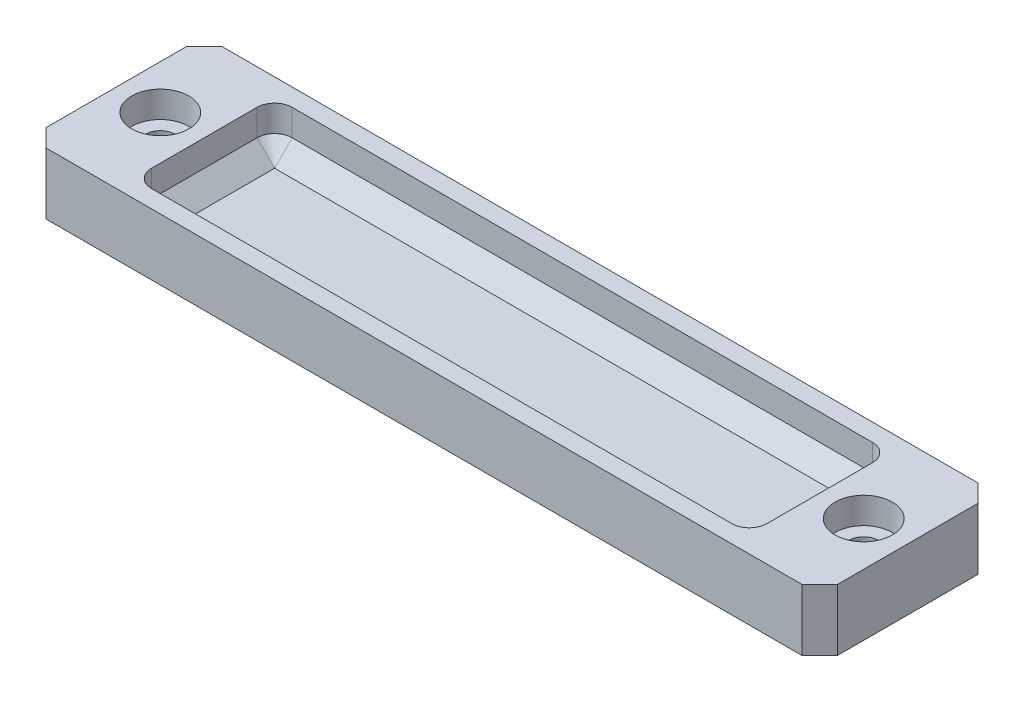
ISO-10303-21;
HEADER;
FILE_DESCRIPTION(('STEP AP214'),'2;1');
FILE_NAME('part.step','',(''),(''),'','','');
FILE_SCHEMA(('AUTOMOTIVE_DESIGN { 1 0 10303 214 1 1 1 1 }'));
ENDSEC;
DATA;
#1=APPLICATION_CONTEXT('core data for automotive mechanical design processes');
#2=APPLICATION_PROTOCOL_DEFINITION('international standard','automotive_design',2000,#1);
#3=PRODUCT_CONTEXT('',#1,'mechanical');
#4=PRODUCT('Part','Part','',(#3));
#5=PRODUCT_RELATED_PRODUCT_CATEGORY('part','',(#4));
#6=PRODUCT_DEFINITION_FORMATION('','',#4);
#7=PRODUCT_DEFINITION_CONTEXT('part definition',#1,'design');
#8=PRODUCT_DEFINITION('design','',#6,#7);
#9=PRODUCT_DEFINITION_SHAPE('','',#8);
#10=(LENGTH_UNIT() NAMED_UNIT(*) SI_UNIT(.MILLI.,.METRE.));
#11=(NAMED_UNIT(*) PLANE_ANGLE_UNIT() SI_UNIT($,.RADIAN.));
#12=(NAMED_UNIT(*) SI_UNIT($,.STERADIAN.) SOLID_ANGLE_UNIT());
#13=UNCERTAINTY_MEASURE_WITH_UNIT(LENGTH_MEASURE(1.E-05),#10,'distance_accuracy_value','');
#14=(GEOMETRIC_REPRESENTATION_CONTEXT(3) GLOBAL_UNCERTAINTY_ASSIGNED_CONTEXT((#13)) GLOBAL_UNIT_ASSIGNED_CONTEXT((#10,
#11,#12)) REPRESENTATION_CONTEXT('',''));
#15=CARTESIAN_POINT('',(0.,0.,0.));
#16=DIRECTION('',(0.,0.,1.));
#17=DIRECTION('',(1.,0.,0.));
#18=AXIS2_PLACEMENT_3D('',#15,#16,#17);
#19=CARTESIAN_POINT('',(45.,7.,10.));
#20=DIRECTION('',(-1.,0.,0.));
#21=DIRECTION('',(0.,0.,1.));
#22=AXIS2_PLACEMENT_3D('',#19,#20,#21);
#23=PLANE('',#22);
#24=DIRECTION('',(0.,0.,-1.));
#25=VECTOR('',#24,1.);
#26=CARTESIAN_POINT('',(45.,0.,10.));
#27=LINE('',#26,#25);
#28=CARTESIAN_POINT('',(45.,0.,8.00000000000001));
#29=VERTEX_POINT('',#28);
#30=CARTESIAN_POINT('',(45.,0.,-8.));
#31=VERTEX_POINT('',#30);
#32=EDGE_CURVE('E203',#29,#31,#27,.T.);
#33=ORIENTED_EDGE('',*,*,#32,.T.);
#34=DIRECTION('',(0.,1.,0.));
#35=VECTOR('',#34,1.);
#36=CARTESIAN_POINT('',(45.,7.,-8.));
#37=LINE('',#36,#35);
#38=CARTESIAN_POINT('',(45.,7.,-8.));
#39=VERTEX_POINT('',#38);
#40=EDGE_CURVE('E227',#31,#39,#37,.T.);
#41=ORIENTED_EDGE('',*,*,#40,.T.);
#42=DIRECTION('',(0.,0.,-1.));
#43=VECTOR('',#42,1.);
#44=CARTESIAN_POINT('',(45.,7.,10.));
#45=LINE('',#44,#43);
#46=CARTESIAN_POINT('',(45.,7.,8.00000000000001));
#47=VERTEX_POINT('',#46);
#48=EDGE_CURVE('E201',#47,#39,#45,.T.);
#49=ORIENTED_EDGE('',*,*,#48,.F.);
#50=DIRECTION('',(0.,-1.,0.));
#51=VECTOR('',#50,1.);
#52=CARTESIAN_POINT('',(45.,7.,8.00000000000001));
#53=LINE('',#52,#51);
#54=EDGE_CURVE('E224',#47,#29,#53,.T.);
#55=ORIENTED_EDGE('',*,*,#54,.T.);
#56=EDGE_LOOP('',(#33,#41,#49,#55));
#57=FACE_BOUND('',#56,.T.);
#58=ADVANCED_FACE('F43',(#57),#23,.F.);
#59=CARTESIAN_POINT('',(-45.,7.,-10.));
#60=DIRECTION('',(0.,0.,1.));
#61=DIRECTION('',(1.,0.,0.));
#62=AXIS2_PLACEMENT_3D('',#59,#60,#61);
#63=PLANE('',#62);
#64=DIRECTION('',(-1.,0.,0.));
#65=VECTOR('',#64,1.);
#66=CARTESIAN_POINT('',(-45.,0.,-10.));
#67=LINE('',#66,#65);
#68=CARTESIAN_POINT('',(43.,0.,-10.));
#69=VERTEX_POINT('',#68);
#70=CARTESIAN_POINT('',(-43.,0.,-10.));
#71=VERTEX_POINT('',#70);
#72=EDGE_CURVE('E198',#69,#71,#67,.T.);
#73=ORIENTED_EDGE('',*,*,#72,.T.);
#74=DIRECTION('',(0.,1.,0.));
#75=VECTOR('',#74,1.);
#76=CARTESIAN_POINT('',(-43.,7.,-10.));
#77=LINE('',#76,#75);
#78=CARTESIAN_POINT('',(-43.,7.,-10.));
#79=VERTEX_POINT('',#78);
#80=EDGE_CURVE('E176',#71,#79,#77,.T.);
#81=ORIENTED_EDGE('',*,*,#80,.T.);
#82=DIRECTION('',(-1.,0.,0.));
#83=VECTOR('',#82,1.);
#84=CARTESIAN_POINT('',(-45.,7.,-10.));
#85=LINE('',#84,#83);
#86=CARTESIAN_POINT('',(43.,7.,-10.));
#87=VERTEX_POINT('',#86);
#88=EDGE_CURVE('E345',#87,#79,#85,.T.);
#89=ORIENTED_EDGE('',*,*,#88,.F.);
#90=DIRECTION('',(0.,-1.,0.));
#91=VECTOR('',#90,1.);
#92=CARTESIAN_POINT('',(43.,7.,-10.));
#93=LINE('',#92,#91);
#94=EDGE_CURVE('E181',#87,#69,#93,.T.);
#95=ORIENTED_EDGE('',*,*,#94,.T.);
#96=EDGE_LOOP('',(#73,#81,#89,#95));
#97=FACE_BOUND('',#96,.T.);
#98=ADVANCED_FACE('F364',(#97),#63,.F.);
#99=CARTESIAN_POINT('',(-45.,7.,10.));
#100=DIRECTION('',(1.,0.,0.));
#101=DIRECTION('',(0.,0.,-1.));
#102=AXIS2_PLACEMENT_3D('',#99,#100,#101);
#103=PLANE('',#102);
#104=DIRECTION('',(0.,0.,1.));
#105=VECTOR('',#104,1.);
#106=CARTESIAN_POINT('',(-45.,7.,10.));
#107=LINE('',#106,#105);
#108=CARTESIAN_POINT('',(-45.,7.,-7.99999999999999));
#109=VERTEX_POINT('',#108);
#110=CARTESIAN_POINT('',(-45.,7.,8.));
#111=VERTEX_POINT('',#110);
#112=EDGE_CURVE('E191',#109,#111,#107,.T.);
#113=ORIENTED_EDGE('',*,*,#112,.F.);
#114=DIRECTION('',(0.,-1.,0.));
#115=VECTOR('',#114,1.);
#116=CARTESIAN_POINT('',(-45.,7.,-7.99999999999999));
#117=LINE('',#116,#115);
#118=CARTESIAN_POINT('',(-45.,0.,-7.99999999999999));
#119=VERTEX_POINT('',#118);
#120=EDGE_CURVE('E175',#109,#119,#117,.T.);
#121=ORIENTED_EDGE('',*,*,#120,.T.);
#122=DIRECTION('',(0.,0.,1.));
#123=VECTOR('',#122,1.);
#124=CARTESIAN_POINT('',(-45.,0.,10.));
#125=LINE('',#124,#123);
#126=CARTESIAN_POINT('',(-45.,0.,8.));
#127=VERTEX_POINT('',#126);
#128=EDGE_CURVE('E188',#119,#127,#125,.T.);
#129=ORIENTED_EDGE('',*,*,#128,.T.);
#130=DIRECTION('',(0.,1.,0.));
#131=VECTOR('',#130,1.);
#132=CARTESIAN_POINT('',(-45.,7.,8.));
#133=LINE('',#132,#131);
#134=EDGE_CURVE('E193',#127,#111,#133,.T.);
#135=ORIENTED_EDGE('',*,*,#134,.T.);
#136=EDGE_LOOP('',(#113,#121,#129,#135));
#137=FACE_BOUND('',#136,.T.);
#138=ADVANCED_FACE('F187',(#137),#103,.F.);
#139=CARTESIAN_POINT('',(-45.,7.,10.));
#140=DIRECTION('',(0.,0.,-1.));
#141=DIRECTION('',(-1.,0.,0.));
#142=AXIS2_PLACEMENT_3D('',#139,#140,#141);
#143=PLANE('',#142);
#144=DIRECTION('',(1.,0.,0.));
#145=VECTOR('',#144,1.);
#146=CARTESIAN_POINT('',(-45.,0.,10.));
#147=LINE('',#146,#145);
#148=CARTESIAN_POINT('',(-43.,0.,10.));
#149=VERTEX_POINT('',#148);
#150=CARTESIAN_POINT('',(43.,0.,10.));
#151=VERTEX_POINT('',#150);
#152=EDGE_CURVE('E197',#149,#151,#147,.T.);
#153=ORIENTED_EDGE('',*,*,#152,.T.);
#154=DIRECTION('',(0.,1.,0.));
#155=VECTOR('',#154,1.);
#156=CARTESIAN_POINT('',(43.,7.,10.));
#157=LINE('',#156,#155);
#158=CARTESIAN_POINT('',(43.,7.,10.));
#159=VERTEX_POINT('',#158);
#160=EDGE_CURVE('E232',#151,#159,#157,.T.);
#161=ORIENTED_EDGE('',*,*,#160,.T.);
#162=DIRECTION('',(1.,0.,0.));
#163=VECTOR('',#162,1.);
#164=CARTESIAN_POINT('',(-45.,7.,10.));
#165=LINE('',#164,#163);
#166=CARTESIAN_POINT('',(-43.,7.,10.));
#167=VERTEX_POINT('',#166);
#168=EDGE_CURVE('E207',#167,#159,#165,.T.);
#169=ORIENTED_EDGE('',*,*,#168,.F.);
#170=DIRECTION('',(0.,-1.,0.));
#171=VECTOR('',#170,1.);
#172=CARTESIAN_POINT('',(-43.,7.,10.));
#173=LINE('',#172,#171);
#174=EDGE_CURVE('E229',#167,#149,#173,.T.);
#175=ORIENTED_EDGE('',*,*,#174,.T.);
#176=EDGE_LOOP('',(#153,#161,#169,#175));
#177=FACE_BOUND('',#176,.T.);
#178=ADVANCED_FACE('F371',(#177),#143,.F.);
#179=CARTESIAN_POINT('',(0.,7.,0.));
#180=DIRECTION('',(0.,-1.,0.));
#181=DIRECTION('',(0.,0.,-1.));
#182=AXIS2_PLACEMENT_3D('',#179,#180,#181);
#183=PLANE('',#182);
#184=DIRECTION('',(0.,0.,1.));
#185=VECTOR('',#184,1.);
#186=CARTESIAN_POINT('',(-35.,7.,8.));
#187=LINE('',#186,#185);
#188=CARTESIAN_POINT('',(-35.,7.,-6.));
#189=VERTEX_POINT('',#188);
#190=CARTESIAN_POINT('',(-35.,7.,6.));
#191=VERTEX_POINT('',#190);
#192=EDGE_CURVE('E314',#189,#191,#187,.T.);
#193=ORIENTED_EDGE('',*,*,#192,.F.);
#194=CARTESIAN_POINT('',(-33.,7.00000000000001,-6.));
#195=DIRECTION('',(0.,-1.,0.));
#196=DIRECTION('',(0.,0.,-1.));
#197=AXIS2_PLACEMENT_3D('',#194,#195,#196);
#198=CIRCLE('',#197,2.);
#199=CARTESIAN_POINT('',(-33.,7.,-8.));
#200=VERTEX_POINT('',#199);
#201=EDGE_CURVE('E256',#189,#200,#198,.T.);
#202=ORIENTED_EDGE('',*,*,#201,.T.);
#203=DIRECTION('',(-1.,0.,0.));
#204=VECTOR('',#203,1.);
#205=CARTESIAN_POINT('',(-35.,7.,-8.));
#206=LINE('',#205,#204);
#207=CARTESIAN_POINT('',(33.,7.,-8.));
#208=VERTEX_POINT('',#207);
#209=EDGE_CURVE('E309',#208,#200,#206,.T.);
#210=ORIENTED_EDGE('',*,*,#209,.F.);
#211=CARTESIAN_POINT('',(33.,7.00000000000001,-6.));
#212=DIRECTION('',(0.,-1.,0.));
#213=DIRECTION('',(0.,0.,-1.));
#214=AXIS2_PLACEMENT_3D('',#211,#212,#213);
#215=CIRCLE('',#214,2.);
#216=CARTESIAN_POINT('',(35.,7.,-6.));
#217=VERTEX_POINT('',#216);
#218=EDGE_CURVE('E254',#208,#217,#215,.T.);
#219=ORIENTED_EDGE('',*,*,#218,.T.);
#220=DIRECTION('',(0.,0.,-1.));
#221=VECTOR('',#220,1.);
#222=CARTESIAN_POINT('',(35.,7.,8.));
#223=LINE('',#222,#221);
#224=CARTESIAN_POINT('',(35.,7.,6.));
#225=VERTEX_POINT('',#224);
#226=EDGE_CURVE('E304',#225,#217,#223,.T.);
#227=ORIENTED_EDGE('',*,*,#226,.F.);
#228=CARTESIAN_POINT('',(33.,7.00000000000001,6.));
#229=DIRECTION('',(0.,-1.,0.));
#230=DIRECTION('',(0.,0.,-1.));
#231=AXIS2_PLACEMENT_3D('',#228,#229,#230);
#232=CIRCLE('',#231,2.);
#233=CARTESIAN_POINT('',(33.,7.,8.));
#234=VERTEX_POINT('',#233);
#235=EDGE_CURVE('E252',#225,#234,#232,.T.);
#236=ORIENTED_EDGE('',*,*,#235,.T.);
#237=DIRECTION('',(1.,0.,0.));
#238=VECTOR('',#237,1.);
#239=CARTESIAN_POINT('',(-35.,7.,8.));
#240=LINE('',#239,#238);
#241=CARTESIAN_POINT('',(-33.,7.,8.));
#242=VERTEX_POINT('',#241);
#243=EDGE_CURVE('E322',#242,#234,#240,.T.);
#244=ORIENTED_EDGE('',*,*,#243,.F.);
#245=CARTESIAN_POINT('',(-33.,7.00000000000001,6.));
#246=DIRECTION('',(0.,-1.,0.));
#247=DIRECTION('',(0.,0.,-1.));
#248=AXIS2_PLACEMENT_3D('',#245,#246,#247);
#249=CIRCLE('',#248,2.);
#250=EDGE_CURVE('E258',#242,#191,#249,.T.);
#251=ORIENTED_EDGE('',*,*,#250,.T.);
#252=EDGE_LOOP('',(#193,#202,#210,#219,#227,#236,#244,#251));
#253=FACE_BOUND('',#252,.T.);
#254=CARTESIAN_POINT('',(40.,7.,0.));
#255=DIRECTION('',(0.,1.,0.));
#256=DIRECTION('',(0.,0.,1.));
#257=AXIS2_PLACEMENT_3D('',#254,#255,#256);
#258=CIRCLE('',#257,3.25);
#259=CARTESIAN_POINT('',(40.,7.,3.24999999999998));
#260=VERTEX_POINT('',#259);
#261=EDGE_CURVE('E318',#260,#260,#258,.T.);
#262=ORIENTED_EDGE('',*,*,#261,.F.);
#263=EDGE_LOOP('',(#262));
#264=FACE_BOUND('',#263,.T.);
#265=CARTESIAN_POINT('',(-40.,7.,0.));
#266=DIRECTION('',(0.,1.,0.));
#267=DIRECTION('',(0.,0.,1.));
#268=AXIS2_PLACEMENT_3D('',#265,#266,#267);
#269=CIRCLE('',#268,3.25);
#270=CARTESIAN_POINT('',(-40.,7.,3.25));
#271=VERTEX_POINT('',#270);
#272=EDGE_CURVE('E331',#271,#271,#269,.T.);
#273=ORIENTED_EDGE('',*,*,#272,.F.);
#274=EDGE_LOOP('',(#273));
#275=FACE_BOUND('',#274,.T.);
#276=ORIENTED_EDGE('',*,*,#88,.T.);
#277=DIRECTION('',(0.707106781186548,0.,-0.707106781186548));
#278=VECTOR('',#277,1.);
#279=CARTESIAN_POINT('',(-45.,7.,-7.99999999999999));
#280=LINE('',#279,#278);
#281=EDGE_CURVE('E222',#79,#109,#280,.F.);
#282=ORIENTED_EDGE('',*,*,#281,.T.);
#283=ORIENTED_EDGE('',*,*,#112,.T.);
#284=DIRECTION('',(-0.707106781186545,0.,-0.70710678118655));
#285=VECTOR('',#284,1.);
#286=CARTESIAN_POINT('',(-43.,7.,10.));
#287=LINE('',#286,#285);
#288=EDGE_CURVE('E216',#111,#167,#287,.F.);
#289=ORIENTED_EDGE('',*,*,#288,.T.);
#290=ORIENTED_EDGE('',*,*,#168,.T.);
#291=DIRECTION('',(-0.70710678118655,0.,0.707106781186545));
#292=VECTOR('',#291,1.);
#293=CARTESIAN_POINT('',(45.,7.,8.00000000000001));
#294=LINE('',#293,#292);
#295=EDGE_CURVE('E218',#159,#47,#294,.F.);
#296=ORIENTED_EDGE('',*,*,#295,.T.);
#297=ORIENTED_EDGE('',*,*,#48,.T.);
#298=DIRECTION('',(0.707106781186545,0.,0.70710678118655));
#299=VECTOR('',#298,1.);
#300=CARTESIAN_POINT('',(43.,7.,-10.));
#301=LINE('',#300,#299);
#302=EDGE_CURVE('E220',#39,#87,#301,.F.);
#303=ORIENTED_EDGE('',*,*,#302,.T.);
#304=EDGE_LOOP('',(#276,#282,#283,#289,#290,#296,#297,#303));
#305=FACE_BOUND('',#304,.T.);
#306=ADVANCED_FACE('F362',(#253,#264,#275,#305),#183,.F.);
#307=CARTESIAN_POINT('',(0.,0.,0.));
#308=DIRECTION('',(0.,-1.,0.));
#309=DIRECTION('',(0.,0.,-1.));
#310=AXIS2_PLACEMENT_3D('',#307,#308,#309);
#311=PLANE('',#310);
#312=CARTESIAN_POINT('',(40.,0.,0.));
#313=DIRECTION('',(0.,1.,0.));
#314=DIRECTION('',(0.,0.,1.));
#315=AXIS2_PLACEMENT_3D('',#312,#313,#314);
#316=CIRCLE('',#315,1.7);
#317=CARTESIAN_POINT('',(40.,0.,1.69999999999999));
#318=VERTEX_POINT('',#317);
#319=EDGE_CURVE('E328',#318,#318,#316,.T.);
#320=ORIENTED_EDGE('',*,*,#319,.T.);
#321=EDGE_LOOP('',(#320));
#322=FACE_BOUND('',#321,.T.);
#323=CARTESIAN_POINT('',(-40.,0.,0.));
#324=DIRECTION('',(0.,1.,0.));
#325=DIRECTION('',(0.,0.,1.));
#326=AXIS2_PLACEMENT_3D('',#323,#324,#325);
#327=CIRCLE('',#326,1.7);
#328=CARTESIAN_POINT('',(-40.,0.,1.7));
#329=VERTEX_POINT('',#328);
#330=EDGE_CURVE('E340',#329,#329,#327,.T.);
#331=ORIENTED_EDGE('',*,*,#330,.T.);
#332=EDGE_LOOP('',(#331));
#333=FACE_BOUND('',#332,.T.);
#334=ORIENTED_EDGE('',*,*,#128,.F.);
#335=DIRECTION('',(-0.707106781186548,0.,0.707106781186548));
#336=VECTOR('',#335,1.);
#337=CARTESIAN_POINT('',(-26.5,0.,-26.5));
#338=LINE('',#337,#336);
#339=EDGE_CURVE('E171',#119,#71,#338,.F.);
#340=ORIENTED_EDGE('',*,*,#339,.T.);
#341=ORIENTED_EDGE('',*,*,#72,.F.);
#342=DIRECTION('',(-0.707106781186545,0.,-0.70710678118655));
#343=VECTOR('',#342,1.);
#344=CARTESIAN_POINT('',(26.5000000000002,0.,-26.5));
#345=LINE('',#344,#343);
#346=EDGE_CURVE('E182',#69,#31,#345,.F.);
#347=ORIENTED_EDGE('',*,*,#346,.T.);
#348=ORIENTED_EDGE('',*,*,#32,.F.);
#349=DIRECTION('',(0.70710678118655,0.,-0.707106781186545));
#350=VECTOR('',#349,1.);
#351=CARTESIAN_POINT('',(26.4999999999999,0.,26.5));
#352=LINE('',#351,#350);
#353=EDGE_CURVE('E210',#29,#151,#352,.F.);
#354=ORIENTED_EDGE('',*,*,#353,.T.);
#355=ORIENTED_EDGE('',*,*,#152,.F.);
#356=DIRECTION('',(0.707106781186545,0.,0.70710678118655));
#357=VECTOR('',#356,1.);
#358=CARTESIAN_POINT('',(-26.5000000000002,0.,26.5));
#359=LINE('',#358,#357);
#360=EDGE_CURVE('E192',#149,#127,#359,.F.);
#361=ORIENTED_EDGE('',*,*,#360,.T.);
#362=EDGE_LOOP('',(#334,#340,#341,#347,#348,#354,#355,#361));
#363=FACE_BOUND('',#362,.T.);
#364=ADVANCED_FACE('F195',(#322,#333,#363),#311,.T.);
#365=CARTESIAN_POINT('',(-40.,7.,0.));
#366=DIRECTION('',(0.,1.,0.));
#367=DIRECTION('',(0.,0.,1.));
#368=AXIS2_PLACEMENT_3D('',#365,#366,#367);
#369=CYLINDRICAL_SURFACE('',#368,1.7);
#370=ORIENTED_EDGE('',*,*,#330,.F.);
#371=EDGE_LOOP('',(#370));
#372=FACE_BOUND('',#371,.T.);
#373=CARTESIAN_POINT('',(-40.,4.,0.));
#374=DIRECTION('',(0.,1.,0.));
#375=DIRECTION('',(0.,0.,1.));
#376=AXIS2_PLACEMENT_3D('',#373,#374,#375);
#377=CIRCLE('',#376,1.7);
#378=CARTESIAN_POINT('',(-40.,4.,1.7));
#379=VERTEX_POINT('',#378);
#380=EDGE_CURVE('E337',#379,#379,#377,.T.);
#381=ORIENTED_EDGE('',*,*,#380,.T.);
#382=EDGE_LOOP('',(#381));
#383=FACE_BOUND('',#382,.T.);
#384=ADVANCED_FACE('F537',(#372,#383),#369,.F.);
#385=CARTESIAN_POINT('',(-38.3,4.,0.));
#386=DIRECTION('',(0.,-1.,0.));
#387=DIRECTION('',(0.,0.,-1.));
#388=AXIS2_PLACEMENT_3D('',#385,#386,#387);
#389=PLANE('',#388);
#390=ORIENTED_EDGE('',*,*,#380,.F.);
#391=EDGE_LOOP('',(#390));
#392=FACE_BOUND('',#391,.T.);
#393=CARTESIAN_POINT('',(-40.,4.,0.));
#394=DIRECTION('',(0.,1.,0.));
#395=DIRECTION('',(0.,0.,1.));
#396=AXIS2_PLACEMENT_3D('',#393,#394,#395);
#397=CIRCLE('',#396,3.25);
#398=CARTESIAN_POINT('',(-40.,4.,3.25));
#399=VERTEX_POINT('',#398);
#400=EDGE_CURVE('E334',#399,#399,#397,.T.);
#401=ORIENTED_EDGE('',*,*,#400,.T.);
#402=EDGE_LOOP('',(#401));
#403=FACE_BOUND('',#402,.T.);
#404=ADVANCED_FACE('F533',(#392,#403),#389,.F.);
#405=CARTESIAN_POINT('',(-40.,7.,0.));
#406=DIRECTION('',(0.,1.,0.));
#407=DIRECTION('',(0.,0.,1.));
#408=AXIS2_PLACEMENT_3D('',#405,#406,#407);
#409=CYLINDRICAL_SURFACE('',#408,3.25);
#410=ORIENTED_EDGE('',*,*,#400,.F.);
#411=EDGE_LOOP('',(#410));
#412=FACE_BOUND('',#411,.T.);
#413=ORIENTED_EDGE('',*,*,#272,.T.);
#414=EDGE_LOOP('',(#413));
#415=FACE_BOUND('',#414,.T.);
#416=ADVANCED_FACE('F529',(#412,#415),#409,.F.);
#417=CARTESIAN_POINT('',(40.,7.,0.));
#418=DIRECTION('',(0.,1.,0.));
#419=DIRECTION('',(0.,0.,1.));
#420=AXIS2_PLACEMENT_3D('',#417,#418,#419);
#421=CYLINDRICAL_SURFACE('',#420,1.7);
#422=ORIENTED_EDGE('',*,*,#319,.F.);
#423=EDGE_LOOP('',(#422));
#424=FACE_BOUND('',#423,.T.);
#425=CARTESIAN_POINT('',(40.,4.,0.));
#426=DIRECTION('',(0.,1.,0.));
#427=DIRECTION('',(0.,0.,1.));
#428=AXIS2_PLACEMENT_3D('',#425,#426,#427);
#429=CIRCLE('',#428,1.7);
#430=CARTESIAN_POINT('',(40.,4.,1.69999999999999));
#431=VERTEX_POINT('',#430);
#432=EDGE_CURVE('E325',#431,#431,#429,.T.);
#433=ORIENTED_EDGE('',*,*,#432,.T.);
#434=EDGE_LOOP('',(#433));
#435=FACE_BOUND('',#434,.T.);
#436=ADVANCED_FACE('F525',(#424,#435),#421,.F.);
#437=CARTESIAN_POINT('',(41.7,4.,0.));
#438=DIRECTION('',(0.,-1.,0.));
#439=DIRECTION('',(0.,0.,-1.));
#440=AXIS2_PLACEMENT_3D('',#437,#438,#439);
#441=PLANE('',#440);
#442=ORIENTED_EDGE('',*,*,#432,.F.);
#443=EDGE_LOOP('',(#442));
#444=FACE_BOUND('',#443,.T.);
#445=CARTESIAN_POINT('',(40.,4.,0.));
#446=DIRECTION('',(0.,1.,0.));
#447=DIRECTION('',(0.,0.,1.));
#448=AXIS2_PLACEMENT_3D('',#445,#446,#447);
#449=CIRCLE('',#448,3.25);
#450=CARTESIAN_POINT('',(40.,4.,3.24999999999998));
#451=VERTEX_POINT('',#450);
#452=EDGE_CURVE('E321',#451,#451,#449,.T.);
#453=ORIENTED_EDGE('',*,*,#452,.T.);
#454=EDGE_LOOP('',(#453));
#455=FACE_BOUND('',#454,.T.);
#456=ADVANCED_FACE('F521',(#444,#455),#441,.F.);
#457=CARTESIAN_POINT('',(40.,7.,0.));
#458=DIRECTION('',(0.,1.,0.));
#459=DIRECTION('',(0.,0.,1.));
#460=AXIS2_PLACEMENT_3D('',#457,#458,#459);
#461=CYLINDRICAL_SURFACE('',#460,3.25);
#462=ORIENTED_EDGE('',*,*,#452,.F.);
#463=EDGE_LOOP('',(#462));
#464=FACE_BOUND('',#463,.T.);
#465=ORIENTED_EDGE('',*,*,#261,.T.);
#466=EDGE_LOOP('',(#465));
#467=FACE_BOUND('',#466,.T.);
#468=ADVANCED_FACE('F517',(#464,#467),#461,.F.);
#469=CARTESIAN_POINT('',(0.,2.,0.));
#470=DIRECTION('',(0.,-1.,0.));
#471=DIRECTION('',(0.,0.,-1.));
#472=AXIS2_PLACEMENT_3D('',#469,#470,#471);
#473=PLANE('',#472);
#474=DIRECTION('',(-1.,0.,0.));
#475=VECTOR('',#474,1.);
#476=CARTESIAN_POINT('',(-33.,2.,-5.99999999999997));
#477=LINE('',#476,#475);
#478=CARTESIAN_POINT('',(33.,2.,-6.));
#479=VERTEX_POINT('',#478);
#480=CARTESIAN_POINT('',(-33.,2.,-5.99999999999997));
#481=VERTEX_POINT('',#480);
#482=EDGE_CURVE('E267',#479,#481,#477,.T.);
#483=ORIENTED_EDGE('',*,*,#482,.T.);
#484=DIRECTION('',(0.,0.,1.));
#485=VECTOR('',#484,1.);
#486=CARTESIAN_POINT('',(-33.,2.,6.));
#487=LINE('',#486,#485);
#488=CARTESIAN_POINT('',(-33.,2.,5.99999999999997));
#489=VERTEX_POINT('',#488);
#490=EDGE_CURVE('E269',#481,#489,#487,.T.);
#491=ORIENTED_EDGE('',*,*,#490,.T.);
#492=DIRECTION('',(1.,0.,0.));
#493=VECTOR('',#492,1.);
#494=CARTESIAN_POINT('',(33.,2.,5.99999999999997));
#495=LINE('',#494,#493);
#496=CARTESIAN_POINT('',(33.,2.,5.99999999999997));
#497=VERTEX_POINT('',#496);
#498=EDGE_CURVE('E263',#489,#497,#495,.T.);
#499=ORIENTED_EDGE('',*,*,#498,.T.);
#500=DIRECTION('',(0.,0.,-1.));
#501=VECTOR('',#500,1.);
#502=CARTESIAN_POINT('',(33.,2.,-6.));
#503=LINE('',#502,#501);
#504=EDGE_CURVE('E265',#497,#479,#503,.T.);
#505=ORIENTED_EDGE('',*,*,#504,.T.);
#506=EDGE_LOOP('',(#483,#491,#499,#505));
#507=FACE_BOUND('',#506,.T.);
#508=ADVANCED_FACE('F514',(#507),#473,.F.);
#509=CARTESIAN_POINT('',(-35.,-71.805292284065,-8.));
#510=DIRECTION('',(0.,0.,-1.));
#511=DIRECTION('',(-1.,0.,0.));
#512=AXIS2_PLACEMENT_3D('',#509,#510,#511);
#513=PLANE('',#512);
#514=DIRECTION('',(0.,1.,0.));
#515=VECTOR('',#514,1.);
#516=CARTESIAN_POINT('',(-33.,2.,-8.));
#517=LINE('',#516,#515);
#518=CARTESIAN_POINT('',(-33.,4.,-8.));
#519=VERTEX_POINT('',#518);
#520=EDGE_CURVE('E242',#200,#519,#517,.F.);
#521=ORIENTED_EDGE('',*,*,#520,.T.);
#522=DIRECTION('',(1.,0.,0.));
#523=VECTOR('',#522,1.);
#524=CARTESIAN_POINT('',(33.,4.,-8.));
#525=LINE('',#524,#523);
#526=CARTESIAN_POINT('',(33.,4.,-8.));
#527=VERTEX_POINT('',#526);
#528=EDGE_CURVE('E276',#519,#527,#525,.T.);
#529=ORIENTED_EDGE('',*,*,#528,.T.);
#530=DIRECTION('',(0.,1.,0.));
#531=VECTOR('',#530,1.);
#532=CARTESIAN_POINT('',(33.,7.00000000000001,-8.));
#533=LINE('',#532,#531);
#534=EDGE_CURVE('E245',#527,#208,#533,.T.);
#535=ORIENTED_EDGE('',*,*,#534,.T.);
#536=ORIENTED_EDGE('',*,*,#209,.T.);
#537=EDGE_LOOP('',(#521,#529,#535,#536));
#538=FACE_BOUND('',#537,.T.);
#539=ADVANCED_FACE('F496',(#538),#513,.F.);
#540=CARTESIAN_POINT('',(-35.,-71.805292284065,8.));
#541=DIRECTION('',(-1.,0.,0.));
#542=DIRECTION('',(0.,0.,1.));
#543=AXIS2_PLACEMENT_3D('',#540,#541,#542);
#544=PLANE('',#543);
#545=DIRECTION('',(0.,1.,0.));
#546=VECTOR('',#545,1.);
#547=CARTESIAN_POINT('',(-35.,2.,6.));
#548=LINE('',#547,#546);
#549=CARTESIAN_POINT('',(-35.,4.,6.));
#550=VERTEX_POINT('',#549);
#551=EDGE_CURVE('E247',#191,#550,#548,.F.);
#552=ORIENTED_EDGE('',*,*,#551,.T.);
#553=DIRECTION('',(0.,0.,-1.));
#554=VECTOR('',#553,1.);
#555=CARTESIAN_POINT('',(-35.,4.,-6.));
#556=LINE('',#555,#554);
#557=CARTESIAN_POINT('',(-35.,4.,-6.));
#558=VERTEX_POINT('',#557);
#559=EDGE_CURVE('E272',#550,#558,#556,.T.);
#560=ORIENTED_EDGE('',*,*,#559,.T.);
#561=DIRECTION('',(0.,1.,0.));
#562=VECTOR('',#561,1.);
#563=CARTESIAN_POINT('',(-35.,7.00000000000001,-6.));
#564=LINE('',#563,#562);
#565=EDGE_CURVE('E250',#558,#189,#564,.T.);
#566=ORIENTED_EDGE('',*,*,#565,.T.);
#567=ORIENTED_EDGE('',*,*,#192,.T.);
#568=EDGE_LOOP('',(#552,#560,#566,#567));
#569=FACE_BOUND('',#568,.T.);
#570=ADVANCED_FACE('F487',(#569),#544,.F.);
#571=CARTESIAN_POINT('',(-35.,-71.805292284065,8.));
#572=DIRECTION('',(0.,0.,1.));
#573=DIRECTION('',(1.,0.,0.));
#574=AXIS2_PLACEMENT_3D('',#571,#572,#573);
#575=PLANE('',#574);
#576=DIRECTION('',(0.,1.,0.));
#577=VECTOR('',#576,1.);
#578=CARTESIAN_POINT('',(33.,2.,8.));
#579=LINE('',#578,#577);
#580=CARTESIAN_POINT('',(33.,4.,8.));
#581=VERTEX_POINT('',#580);
#582=EDGE_CURVE('E240',#234,#581,#579,.F.);
#583=ORIENTED_EDGE('',*,*,#582,.T.);
#584=DIRECTION('',(-1.,0.,0.));
#585=VECTOR('',#584,1.);
#586=CARTESIAN_POINT('',(-33.,4.,8.));
#587=LINE('',#586,#585);
#588=CARTESIAN_POINT('',(-33.,4.,8.));
#589=VERTEX_POINT('',#588);
#590=EDGE_CURVE('E12',#581,#589,#587,.T.);
#591=ORIENTED_EDGE('',*,*,#590,.T.);
#592=DIRECTION('',(0.,1.,0.));
#593=VECTOR('',#592,1.);
#594=CARTESIAN_POINT('',(-33.,7.00000000000001,8.));
#595=LINE('',#594,#593);
#596=EDGE_CURVE('E238',#589,#242,#595,.T.);
#597=ORIENTED_EDGE('',*,*,#596,.T.);
#598=ORIENTED_EDGE('',*,*,#243,.T.);
#599=EDGE_LOOP('',(#583,#591,#597,#598));
#600=FACE_BOUND('',#599,.T.);
#601=ADVANCED_FACE('F475',(#600),#575,.F.);
#602=CARTESIAN_POINT('',(35.,-71.805292284065,8.));
#603=DIRECTION('',(1.,0.,0.));
#604=DIRECTION('',(0.,0.,-1.));
#605=AXIS2_PLACEMENT_3D('',#602,#603,#604);
#606=PLANE('',#605);
#607=DIRECTION('',(0.,1.,0.));
#608=VECTOR('',#607,1.);
#609=CARTESIAN_POINT('',(35.,2.,-6.));
#610=LINE('',#609,#608);
#611=CARTESIAN_POINT('',(35.,4.,-6.));
#612=VERTEX_POINT('',#611);
#613=EDGE_CURVE('E234',#217,#612,#610,.F.);
#614=ORIENTED_EDGE('',*,*,#613,.T.);
#615=DIRECTION('',(0.,0.,1.));
#616=VECTOR('',#615,1.);
#617=CARTESIAN_POINT('',(35.,4.,6.));
#618=LINE('',#617,#616);
#619=CARTESIAN_POINT('',(35.,4.,6.));
#620=VERTEX_POINT('',#619);
#621=EDGE_CURVE('E68',#612,#620,#618,.T.);
#622=ORIENTED_EDGE('',*,*,#621,.T.);
#623=DIRECTION('',(0.,1.,0.));
#624=VECTOR('',#623,1.);
#625=CARTESIAN_POINT('',(35.,7.00000000000001,6.));
#626=LINE('',#625,#624);
#627=EDGE_CURVE('E236',#620,#225,#626,.T.);
#628=ORIENTED_EDGE('',*,*,#627,.T.);
#629=ORIENTED_EDGE('',*,*,#226,.T.);
#630=EDGE_LOOP('',(#614,#622,#628,#629));
#631=FACE_BOUND('',#630,.T.);
#632=ADVANCED_FACE('F382',(#631),#606,.F.);
#633=CARTESIAN_POINT('',(-45.,7.,-7.99999999999999));
#634=DIRECTION('',(0.707106781186547,0.,0.707106781186547));
#635=DIRECTION('',(0.,-1.,0.));
#636=AXIS2_PLACEMENT_3D('',#633,#634,#635);
#637=PLANE('',#636);
#638=ORIENTED_EDGE('',*,*,#281,.F.);
#639=ORIENTED_EDGE('',*,*,#80,.F.);
#640=ORIENTED_EDGE('',*,*,#339,.F.);
#641=ORIENTED_EDGE('',*,*,#120,.F.);
#642=EDGE_LOOP('',(#638,#639,#640,#641));
#643=FACE_BOUND('',#642,.T.);
#644=ADVANCED_FACE('F174',(#643),#637,.F.);
#645=CARTESIAN_POINT('',(43.,7.,-10.));
#646=DIRECTION('',(-0.70710678118655,0.,0.707106781186545));
#647=DIRECTION('',(0.,-1.,0.));
#648=AXIS2_PLACEMENT_3D('',#645,#646,#647);
#649=PLANE('',#648);
#650=ORIENTED_EDGE('',*,*,#302,.F.);
#651=ORIENTED_EDGE('',*,*,#40,.F.);
#652=ORIENTED_EDGE('',*,*,#346,.F.);
#653=ORIENTED_EDGE('',*,*,#94,.F.);
#654=EDGE_LOOP('',(#650,#651,#652,#653));
#655=FACE_BOUND('',#654,.T.);
#656=ADVANCED_FACE('F358',(#655),#649,.F.);
#657=CARTESIAN_POINT('',(45.,7.,8.00000000000001));
#658=DIRECTION('',(-0.707106781186545,0.,-0.70710678118655));
#659=DIRECTION('',(0.,-1.,0.));
#660=AXIS2_PLACEMENT_3D('',#657,#658,#659);
#661=PLANE('',#660);
#662=ORIENTED_EDGE('',*,*,#295,.F.);
#663=ORIENTED_EDGE('',*,*,#160,.F.);
#664=ORIENTED_EDGE('',*,*,#353,.F.);
#665=ORIENTED_EDGE('',*,*,#54,.F.);
#666=EDGE_LOOP('',(#662,#663,#664,#665));
#667=FACE_BOUND('',#666,.T.);
#668=ADVANCED_FACE('F388',(#667),#661,.F.);
#669=CARTESIAN_POINT('',(-43.,7.,10.));
#670=DIRECTION('',(0.70710678118655,0.,-0.707106781186545));
#671=DIRECTION('',(0.,-1.,0.));
#672=AXIS2_PLACEMENT_3D('',#669,#670,#671);
#673=PLANE('',#672);
#674=ORIENTED_EDGE('',*,*,#288,.F.);
#675=ORIENTED_EDGE('',*,*,#134,.F.);
#676=ORIENTED_EDGE('',*,*,#360,.F.);
#677=ORIENTED_EDGE('',*,*,#174,.F.);
#678=EDGE_LOOP('',(#674,#675,#676,#677));
#679=FACE_BOUND('',#678,.T.);
#680=ADVANCED_FACE('F394',(#679),#673,.F.);
#681=CARTESIAN_POINT('',(33.,-71.805292284065,6.));
#682=DIRECTION('',(0.,-1.,0.));
#683=DIRECTION('',(0.,0.,-1.));
#684=AXIS2_PLACEMENT_3D('',#681,#682,#683);
#685=CYLINDRICAL_SURFACE('',#684,2.);
#686=ORIENTED_EDGE('',*,*,#627,.F.);
#687=CARTESIAN_POINT('',(33.,4.,6.));
#688=DIRECTION('',(0.,-1.,0.));
#689=DIRECTION('',(0.,0.,-1.));
#690=AXIS2_PLACEMENT_3D('',#687,#688,#689);
#691=CIRCLE('',#690,2.);
#692=EDGE_CURVE('E53',#620,#581,#691,.T.);
#693=ORIENTED_EDGE('',*,*,#692,.T.);
#694=ORIENTED_EDGE('',*,*,#582,.F.);
#695=ORIENTED_EDGE('',*,*,#235,.F.);
#696=EDGE_LOOP('',(#686,#693,#694,#695));
#697=FACE_BOUND('',#696,.T.);
#698=ADVANCED_FACE('F400',(#697),#685,.F.);
#699=CARTESIAN_POINT('',(33.,-71.805292284065,-6.));
#700=DIRECTION('',(0.,-1.,0.));
#701=DIRECTION('',(0.,0.,-1.));
#702=AXIS2_PLACEMENT_3D('',#699,#700,#701);
#703=CYLINDRICAL_SURFACE('',#702,2.);
#704=ORIENTED_EDGE('',*,*,#534,.F.);
#705=CARTESIAN_POINT('',(33.,4.,-6.));
#706=DIRECTION('',(0.,-1.,0.));
#707=DIRECTION('',(0.,0.,-1.));
#708=AXIS2_PLACEMENT_3D('',#705,#706,#707);
#709=CIRCLE('',#708,2.);
#710=EDGE_CURVE('E278',#527,#612,#709,.T.);
#711=ORIENTED_EDGE('',*,*,#710,.T.);
#712=ORIENTED_EDGE('',*,*,#613,.F.);
#713=ORIENTED_EDGE('',*,*,#218,.F.);
#714=EDGE_LOOP('',(#704,#711,#712,#713));
#715=FACE_BOUND('',#714,.T.);
#716=ADVANCED_FACE('F404',(#715),#703,.F.);
#717=CARTESIAN_POINT('',(-33.,-71.805292284065,-6.));
#718=DIRECTION('',(0.,-1.,0.));
#719=DIRECTION('',(0.,0.,-1.));
#720=AXIS2_PLACEMENT_3D('',#717,#718,#719);
#721=CYLINDRICAL_SURFACE('',#720,2.);
#722=ORIENTED_EDGE('',*,*,#565,.F.);
#723=CARTESIAN_POINT('',(-33.,4.,-6.));
#724=DIRECTION('',(0.,-1.,0.));
#725=DIRECTION('',(0.,0.,-1.));
#726=AXIS2_PLACEMENT_3D('',#723,#724,#725);
#727=CIRCLE('',#726,2.);
#728=EDGE_CURVE('E274',#558,#519,#727,.T.);
#729=ORIENTED_EDGE('',*,*,#728,.T.);
#730=ORIENTED_EDGE('',*,*,#520,.F.);
#731=ORIENTED_EDGE('',*,*,#201,.F.);
#732=EDGE_LOOP('',(#722,#729,#730,#731));
#733=FACE_BOUND('',#732,.T.);
#734=ADVANCED_FACE('F407',(#733),#721,.F.);
#735=CARTESIAN_POINT('',(-33.,-71.805292284065,6.));
#736=DIRECTION('',(0.,-1.,0.));
#737=DIRECTION('',(0.,0.,-1.));
#738=AXIS2_PLACEMENT_3D('',#735,#736,#737);
#739=CYLINDRICAL_SURFACE('',#738,2.);
#740=ORIENTED_EDGE('',*,*,#596,.F.);
#741=CARTESIAN_POINT('',(-33.,4.,6.));
#742=DIRECTION('',(0.,-1.,0.));
#743=DIRECTION('',(0.,0.,-1.));
#744=AXIS2_PLACEMENT_3D('',#741,#742,#743);
#745=CIRCLE('',#744,2.);
#746=EDGE_CURVE('E260',#589,#550,#745,.T.);
#747=ORIENTED_EDGE('',*,*,#746,.T.);
#748=ORIENTED_EDGE('',*,*,#551,.F.);
#749=ORIENTED_EDGE('',*,*,#250,.F.);
#750=EDGE_LOOP('',(#740,#747,#748,#749));
#751=FACE_BOUND('',#750,.T.);
#752=ADVANCED_FACE('F411',(#751),#739,.F.);
#753=CARTESIAN_POINT('',(33.,4.,-6.));
#754=DIRECTION('',(0.,1.,0.));
#755=DIRECTION('',(0.,0.,1.));
#756=AXIS2_PLACEMENT_3D('',#753,#754,#755);
#757=CONICAL_SURFACE('',#756,2.00000000000003,0.785398163397455);
#758=DIRECTION('',(-0.707106781186552,-0.707106781186543,0.));
#759=VECTOR('',#758,1.);
#760=CARTESIAN_POINT('',(35.,4.,-6.));
#761=LINE('',#760,#759);
#762=EDGE_CURVE('E297',#612,#479,#761,.T.);
#763=ORIENTED_EDGE('',*,*,#762,.F.);
#764=ORIENTED_EDGE('',*,*,#710,.F.);
#765=DIRECTION('',(0.,0.707106781186543,-0.707106781186552));
#766=VECTOR('',#765,1.);
#767=CARTESIAN_POINT('',(33.,2.,-5.99999999999997));
#768=LINE('',#767,#766);
#769=EDGE_CURVE('E48',#479,#527,#768,.T.);
#770=ORIENTED_EDGE('',*,*,#769,.F.);
#771=EDGE_LOOP('',(#763,#764,#770));
#772=FACE_BOUND('',#771,.T.);
#773=ADVANCED_FACE('F46',(#772),#757,.F.);
#774=CARTESIAN_POINT('',(0.,2.,-5.99999999999997));
#775=DIRECTION('',(0.,0.707106781186552,0.707106781186543));
#776=DIRECTION('',(1.,0.,0.));
#777=AXIS2_PLACEMENT_3D('',#774,#775,#776);
#778=PLANE('',#777);
#779=ORIENTED_EDGE('',*,*,#769,.T.);
#780=ORIENTED_EDGE('',*,*,#528,.F.);
#781=DIRECTION('',(0.,0.707106781186543,-0.707106781186552));
#782=VECTOR('',#781,1.);
#783=CARTESIAN_POINT('',(-33.,2.,-5.99999999999997));
#784=LINE('',#783,#782);
#785=EDGE_CURVE('E295',#481,#519,#784,.T.);
#786=ORIENTED_EDGE('',*,*,#785,.F.);
#787=ORIENTED_EDGE('',*,*,#482,.F.);
#788=EDGE_LOOP('',(#779,#780,#786,#787));
#789=FACE_BOUND('',#788,.T.);
#790=ADVANCED_FACE('F457',(#789),#778,.T.);
#791=CARTESIAN_POINT('',(33.,2.,0.));
#792=DIRECTION('',(-0.707106781186543,0.707106781186552,0.));
#793=DIRECTION('',(0.,0.,1.));
#794=AXIS2_PLACEMENT_3D('',#791,#792,#793);
#795=PLANE('',#794);
#796=ORIENTED_EDGE('',*,*,#762,.T.);
#797=ORIENTED_EDGE('',*,*,#504,.F.);
#798=DIRECTION('',(-0.707106781186552,-0.707106781186543,0.));
#799=VECTOR('',#798,1.);
#800=CARTESIAN_POINT('',(35.,4.,6.));
#801=LINE('',#800,#799);
#802=EDGE_CURVE('E292',#620,#497,#801,.T.);
#803=ORIENTED_EDGE('',*,*,#802,.F.);
#804=ORIENTED_EDGE('',*,*,#621,.F.);
#805=EDGE_LOOP('',(#796,#797,#803,#804));
#806=FACE_BOUND('',#805,.T.);
#807=ADVANCED_FACE('F451',(#806),#795,.T.);
#808=CARTESIAN_POINT('',(-33.,4.,-6.));
#809=DIRECTION('',(0.,1.,0.));
#810=DIRECTION('',(0.,0.,1.));
#811=AXIS2_PLACEMENT_3D('',#808,#809,#810);
#812=CONICAL_SURFACE('',#811,2.00000000000003,0.785398163397455);
#813=ORIENTED_EDGE('',*,*,#785,.T.);
#814=ORIENTED_EDGE('',*,*,#728,.F.);
#815=DIRECTION('',(-0.707106781186552,0.707106781186543,0.));
#816=VECTOR('',#815,1.);
#817=CARTESIAN_POINT('',(-33.,2.,-6.));
#818=LINE('',#817,#816);
#819=EDGE_CURVE('E289',#481,#558,#818,.T.);
#820=ORIENTED_EDGE('',*,*,#819,.F.);
#821=EDGE_LOOP('',(#813,#814,#820));
#822=FACE_BOUND('',#821,.T.);
#823=ADVANCED_FACE('F444',(#822),#812,.F.);
#824=CARTESIAN_POINT('',(33.,4.,6.));
#825=DIRECTION('',(0.,1.,0.));
#826=DIRECTION('',(0.,0.,1.));
#827=AXIS2_PLACEMENT_3D('',#824,#825,#826);
#828=CONICAL_SURFACE('',#827,2.00000000000003,0.785398163397455);
#829=ORIENTED_EDGE('',*,*,#692,.F.);
#830=ORIENTED_EDGE('',*,*,#802,.T.);
#831=DIRECTION('',(0.,-0.707106781186543,-0.707106781186552));
#832=VECTOR('',#831,1.);
#833=CARTESIAN_POINT('',(33.,4.,8.));
#834=LINE('',#833,#832);
#835=EDGE_CURVE('E286',#581,#497,#834,.T.);
#836=ORIENTED_EDGE('',*,*,#835,.F.);
#837=EDGE_LOOP('',(#829,#830,#836));
#838=FACE_BOUND('',#837,.T.);
#839=ADVANCED_FACE('F437',(#838),#828,.F.);
#840=CARTESIAN_POINT('',(-33.,2.,0.));
#841=DIRECTION('',(0.707106781186543,0.707106781186552,0.));
#842=DIRECTION('',(0.,0.,-1.));
#843=AXIS2_PLACEMENT_3D('',#840,#841,#842);
#844=PLANE('',#843);
#845=ORIENTED_EDGE('',*,*,#819,.T.);
#846=ORIENTED_EDGE('',*,*,#559,.F.);
#847=DIRECTION('',(-0.707106781186552,0.707106781186543,0.));
#848=VECTOR('',#847,1.);
#849=CARTESIAN_POINT('',(-33.,2.,6.));
#850=LINE('',#849,#848);
#851=EDGE_CURVE('E284',#489,#550,#850,.T.);
#852=ORIENTED_EDGE('',*,*,#851,.F.);
#853=ORIENTED_EDGE('',*,*,#490,.F.);
#854=EDGE_LOOP('',(#845,#846,#852,#853));
#855=FACE_BOUND('',#854,.T.);
#856=ADVANCED_FACE('F430',(#855),#844,.T.);
#857=CARTESIAN_POINT('',(0.,2.,5.99999999999997));
#858=DIRECTION('',(0.,0.707106781186552,-0.707106781186543));
#859=DIRECTION('',(-1.,0.,0.));
#860=AXIS2_PLACEMENT_3D('',#857,#858,#859);
#861=PLANE('',#860);
#862=ORIENTED_EDGE('',*,*,#835,.T.);
#863=ORIENTED_EDGE('',*,*,#498,.F.);
#864=DIRECTION('',(0.,-0.707106781186543,-0.707106781186552));
#865=VECTOR('',#864,1.);
#866=CARTESIAN_POINT('',(-33.,4.,8.));
#867=LINE('',#866,#865);
#868=EDGE_CURVE('E282',#589,#489,#867,.T.);
#869=ORIENTED_EDGE('',*,*,#868,.F.);
#870=ORIENTED_EDGE('',*,*,#590,.F.);
#871=EDGE_LOOP('',(#862,#863,#869,#870));
#872=FACE_BOUND('',#871,.T.);
#873=ADVANCED_FACE('F423',(#872),#861,.T.);
#874=CARTESIAN_POINT('',(-33.,4.,6.));
#875=DIRECTION('',(0.,1.,0.));
#876=DIRECTION('',(0.,0.,1.));
#877=AXIS2_PLACEMENT_3D('',#874,#875,#876);
#878=CONICAL_SURFACE('',#877,2.00000000000003,0.785398163397455);
#879=ORIENTED_EDGE('',*,*,#851,.T.);
#880=ORIENTED_EDGE('',*,*,#746,.F.);
#881=ORIENTED_EDGE('',*,*,#868,.T.);
#882=EDGE_LOOP('',(#879,#880,#881));
#883=FACE_BOUND('',#882,.T.);
#884=ADVANCED_FACE('F417',(#883),#878,.F.);
#885=CLOSED_SHELL('',(#58,#98,#138,#178,#306,#364,#384,#404,#416,#436,#456,#468,#508,#539,#570,
#601,#632,#644,#656,#668,#680,#698,#716,#734,#752,#773,#790,#807,#823,#839,#856,#873,#884));
#886=MANIFOLD_SOLID_BREP('B2',#885);
#887=ADVANCED_BREP_SHAPE_REPRESENTATION('',(#18,#886),#14);
#888=SHAPE_DEFINITION_REPRESENTATION(#9,#887);
ENDSEC;
END-ISO-10303-21;
